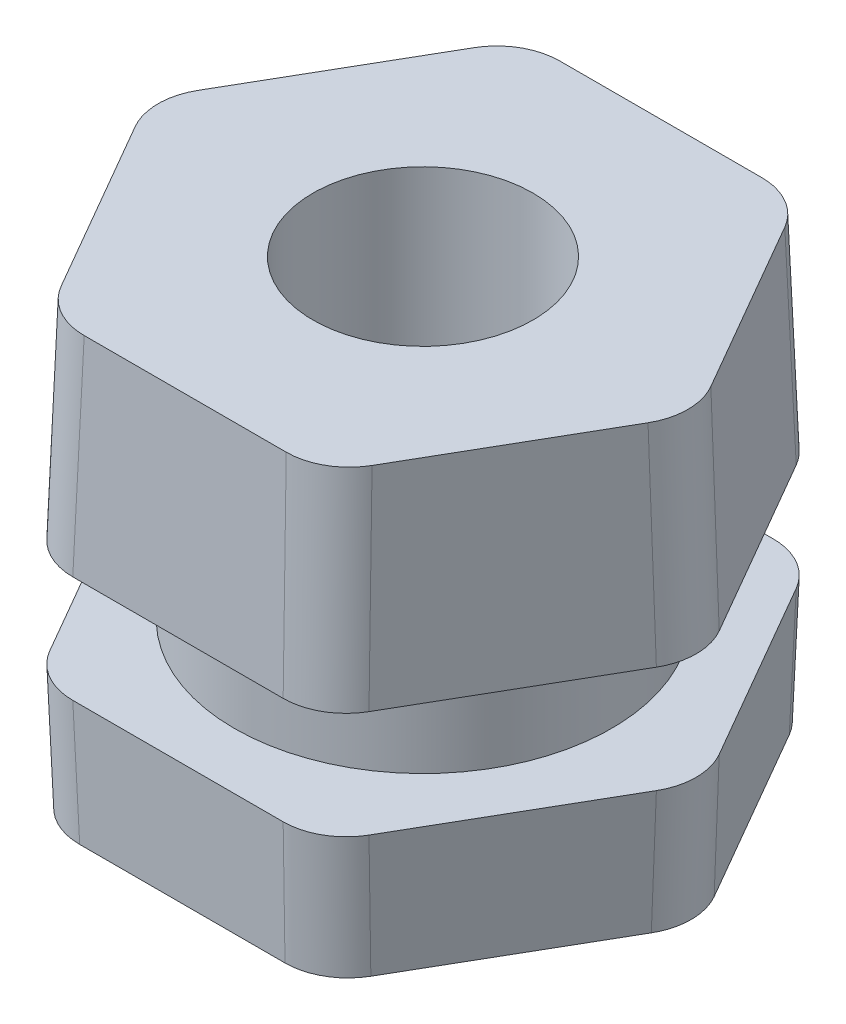
ISO-10303-21;
HEADER;
FILE_DESCRIPTION(('STEP AP214'),'2;1');
FILE_NAME('part.step','',(''),(''),'','','');
FILE_SCHEMA(('AUTOMOTIVE_DESIGN { 1 0 10303 214 1 1 1 1 }'));
ENDSEC;
DATA;
#1=APPLICATION_CONTEXT('core data for automotive mechanical design processes');
#2=APPLICATION_PROTOCOL_DEFINITION('international standard','automotive_design',2000,#1);
#3=PRODUCT_CONTEXT('',#1,'mechanical');
#4=PRODUCT('Part','Part','',(#3));
#5=PRODUCT_RELATED_PRODUCT_CATEGORY('part','',(#4));
#6=PRODUCT_DEFINITION_FORMATION('','',#4);
#7=PRODUCT_DEFINITION_CONTEXT('part definition',#1,'design');
#8=PRODUCT_DEFINITION('design','',#6,#7);
#9=PRODUCT_DEFINITION_SHAPE('','',#8);
#10=(LENGTH_UNIT() NAMED_UNIT(*) SI_UNIT(.MILLI.,.METRE.));
#11=(NAMED_UNIT(*) PLANE_ANGLE_UNIT() SI_UNIT($,.RADIAN.));
#12=(NAMED_UNIT(*) SI_UNIT($,.STERADIAN.) SOLID_ANGLE_UNIT());
#13=UNCERTAINTY_MEASURE_WITH_UNIT(LENGTH_MEASURE(1.E-05),#10,'distance_accuracy_value','');
#14=(GEOMETRIC_REPRESENTATION_CONTEXT(3) GLOBAL_UNCERTAINTY_ASSIGNED_CONTEXT((#13)) GLOBAL_UNIT_ASSIGNED_CONTEXT((#10,
#11,#12)) REPRESENTATION_CONTEXT('',''));
#15=CARTESIAN_POINT('',(0.,0.,0.));
#16=DIRECTION('',(0.,0.,1.));
#17=DIRECTION('',(1.,0.,0.));
#18=AXIS2_PLACEMENT_3D('',#15,#16,#17);
#19=CARTESIAN_POINT('',(3.2,1.28820864064763,0.));
#20=DIRECTION('',(0.,-1.,0.));
#21=DIRECTION('',(0.,0.,-1.));
#22=AXIS2_PLACEMENT_3D('',#19,#20,#21);
#23=PLANE('',#22);
#24=CARTESIAN_POINT('',(0.,1.28820864064763,0.));
#25=DIRECTION('',(0.,-1.,0.));
#26=DIRECTION('',(0.,0.,-1.));
#27=AXIS2_PLACEMENT_3D('',#24,#25,#26);
#28=CIRCLE('',#27,1.12);
#29=CARTESIAN_POINT('',(0.,1.28820864064763,-1.12));
#30=VERTEX_POINT('',#29);
#31=EDGE_CURVE('E431',#30,#30,#28,.T.);
#32=ORIENTED_EDGE('',*,*,#31,.F.);
#33=EDGE_LOOP('',(#32));
#34=FACE_BOUND('',#33,.T.);
#35=DIRECTION('',(0.5,0.,0.866025403784439));
#36=VECTOR('',#35,1.);
#37=CARTESIAN_POINT('',(-1.32128988992057,1.28820864064763,2.61036793502997));
#38=LINE('',#37,#36);
#39=CARTESIAN_POINT('',(-2.64374697973245,1.28820864064763,0.319805064646111));
#40=VERTEX_POINT('',#39);
#41=CARTESIAN_POINT('',(-1.59883280010868,1.28820864064763,2.12964951330364));
#42=VERTEX_POINT('',#41);
#43=EDGE_CURVE('E354',#40,#42,#38,.T.);
#44=ORIENTED_EDGE('',*,*,#43,.F.);
#45=CARTESIAN_POINT('',(-2.08892771700816,1.28820864064763,0.));
#46=DIRECTION('',(0.,-1.,0.));
#47=DIRECTION('',(-1.,0.,0.));
#48=AXIS2_PLACEMENT_3D('',#45,#46,#47);
#49=ELLIPSE('',#48,0.640520091669388,0.64);
#50=CARTESIAN_POINT('',(-2.64374697973245,1.28820864064763,-0.319805064646111));
#51=VERTEX_POINT('',#50);
#52=EDGE_CURVE('E287',#40,#51,#49,.T.);
#53=ORIENTED_EDGE('',*,*,#52,.T.);
#54=DIRECTION('',(-0.5,0.,0.866025403784439));
#55=VECTOR('',#54,1.);
#56=CARTESIAN_POINT('',(-1.32128988992057,1.28820864064763,-2.61036793502997));
#57=LINE('',#56,#55);
#58=CARTESIAN_POINT('',(-1.59883280010868,1.28820864064763,-2.12964951330364));
#59=VERTEX_POINT('',#58);
#60=EDGE_CURVE('E348',#59,#51,#57,.T.);
#61=ORIENTED_EDGE('',*,*,#60,.F.);
#62=CARTESIAN_POINT('',(-1.04446385850408,1.28820864064763,-1.8090644695985));
#63=DIRECTION('',(0.,-1.,0.));
#64=DIRECTION('',(-0.5,0.,-0.866025403784439));
#65=AXIS2_PLACEMENT_3D('',#62,#63,#64);
#66=ELLIPSE('',#65,0.640520091669388,0.64);
#67=CARTESIAN_POINT('',(-1.04491417962377,1.28820864064763,-2.44945457794974));
#68=VERTEX_POINT('',#67);
#69=EDGE_CURVE('E278',#59,#68,#66,.T.);
#70=ORIENTED_EDGE('',*,*,#69,.T.);
#71=DIRECTION('',(-1.,0.,0.));
#72=VECTOR('',#71,1.);
#73=CARTESIAN_POINT('',(3.2,1.28820864064763,-2.44945457794975));
#74=LINE('',#73,#72);
#75=CARTESIAN_POINT('',(1.04491417962377,1.28820864064763,-2.44945457794975));
#76=VERTEX_POINT('',#75);
#77=EDGE_CURVE('E359',#76,#68,#74,.T.);
#78=ORIENTED_EDGE('',*,*,#77,.F.);
#79=CARTESIAN_POINT('',(1.04446385850408,1.28820864064763,-1.8090644695985));
#80=DIRECTION('',(0.,-1.,0.));
#81=DIRECTION('',(0.5,0.,-0.866025403784439));
#82=AXIS2_PLACEMENT_3D('',#79,#80,#81);
#83=ELLIPSE('',#82,0.640520091669388,0.64);
#84=CARTESIAN_POINT('',(1.59883280010868,1.28820864064763,-2.12964951330364));
#85=VERTEX_POINT('',#84);
#86=EDGE_CURVE('E280',#76,#85,#83,.T.);
#87=ORIENTED_EDGE('',*,*,#86,.T.);
#88=DIRECTION('',(-0.5,0.,-0.866025403784438));
#89=VECTOR('',#88,1.);
#90=CARTESIAN_POINT('',(2.92128988992057,1.28820864064763,0.160913357080229));
#91=LINE('',#90,#89);
#92=CARTESIAN_POINT('',(2.64374697973246,1.28820864064763,-0.319805064646111));
#93=VERTEX_POINT('',#92);
#94=EDGE_CURVE('E363',#93,#85,#91,.T.);
#95=ORIENTED_EDGE('',*,*,#94,.F.);
#96=CARTESIAN_POINT('',(2.08892771700816,1.28820864064763,0.));
#97=DIRECTION('',(0.,-1.,0.));
#98=DIRECTION('',(1.,0.,0.));
#99=AXIS2_PLACEMENT_3D('',#96,#97,#98);
#100=ELLIPSE('',#99,0.640520091669388,0.64);
#101=CARTESIAN_POINT('',(2.64374697973246,1.28820864064763,0.319805064646111));
#102=VERTEX_POINT('',#101);
#103=EDGE_CURVE('E282',#93,#102,#100,.T.);
#104=ORIENTED_EDGE('',*,*,#103,.T.);
#105=DIRECTION('',(0.5,0.,-0.866025403784439));
#106=VECTOR('',#105,1.);
#107=CARTESIAN_POINT('',(2.92128988992057,1.28820864064763,-0.160913357080229));
#108=LINE('',#107,#106);
#109=CARTESIAN_POINT('',(1.59883280010869,1.28820864064763,2.12964951330364));
#110=VERTEX_POINT('',#109);
#111=EDGE_CURVE('E365',#110,#102,#108,.T.);
#112=ORIENTED_EDGE('',*,*,#111,.F.);
#113=CARTESIAN_POINT('',(1.04446385850408,1.28820864064763,1.8090644695985));
#114=DIRECTION('',(0.,-1.,0.));
#115=DIRECTION('',(0.5,0.,0.866025403784439));
#116=AXIS2_PLACEMENT_3D('',#113,#114,#115);
#117=ELLIPSE('',#116,0.640520091669388,0.64);
#118=CARTESIAN_POINT('',(1.04491417962377,1.28820864064763,2.44945457794974));
#119=VERTEX_POINT('',#118);
#120=EDGE_CURVE('E49',#110,#119,#117,.T.);
#121=ORIENTED_EDGE('',*,*,#120,.T.);
#122=DIRECTION('',(1.,0.,0.));
#123=VECTOR('',#122,1.);
#124=CARTESIAN_POINT('',(3.2,1.28820864064763,2.44945457794974));
#125=LINE('',#124,#123);
#126=CARTESIAN_POINT('',(-1.04491417962377,1.28820864064763,2.44945457794975));
#127=VERTEX_POINT('',#126);
#128=EDGE_CURVE('E229',#127,#119,#125,.T.);
#129=ORIENTED_EDGE('',*,*,#128,.F.);
#130=CARTESIAN_POINT('',(-1.04446385850408,1.28820864064763,1.8090644695985));
#131=DIRECTION('',(0.,-1.,0.));
#132=DIRECTION('',(-0.5,0.,0.866025403784439));
#133=AXIS2_PLACEMENT_3D('',#130,#131,#132);
#134=ELLIPSE('',#133,0.640520091669388,0.64);
#135=EDGE_CURVE('E285',#127,#42,#134,.T.);
#136=ORIENTED_EDGE('',*,*,#135,.T.);
#137=EDGE_LOOP('',(#44,#53,#61,#70,#78,#87,#95,#104,#112,#121,#129,#136));
#138=FACE_BOUND('',#137,.T.);
#139=ADVANCED_FACE('F34',(#34,#138),#23,.T.);
#140=CARTESIAN_POINT('',(1.12,5.76820864064763,0.));
#141=DIRECTION('',(0.,1.,0.));
#142=DIRECTION('',(0.,0.,1.));
#143=AXIS2_PLACEMENT_3D('',#140,#141,#142);
#144=PLANE('',#143);
#145=CARTESIAN_POINT('',(0.,5.76820864064763,0.));
#146=DIRECTION('',(0.,-1.,0.));
#147=DIRECTION('',(0.,0.,-1.));
#148=AXIS2_PLACEMENT_3D('',#145,#146,#147);
#149=CIRCLE('',#148,1.12);
#150=CARTESIAN_POINT('',(0.,5.76820864064763,-1.12));
#151=VERTEX_POINT('',#150);
#152=EDGE_CURVE('E428',#151,#151,#149,.T.);
#153=ORIENTED_EDGE('',*,*,#152,.T.);
#154=EDGE_LOOP('',(#153));
#155=FACE_BOUND('',#154,.T.);
#156=DIRECTION('',(-0.5,0.,0.866025403784439));
#157=VECTOR('',#156,1.);
#158=CARTESIAN_POINT('',(-1.81612831836894,5.76820864064763,-1.69517447498559));
#159=LINE('',#158,#157);
#160=CARTESIAN_POINT('',(-1.58205841907427,5.76820864064763,-2.1005954330865));
#161=VERTEX_POINT('',#160);
#162=CARTESIAN_POINT('',(-2.61019821766362,5.76820864064763,-0.31980506464611));
#163=VERTEX_POINT('',#162);
#164=EDGE_CURVE('E200',#161,#163,#159,.T.);
#165=ORIENTED_EDGE('',*,*,#164,.T.);
#166=CARTESIAN_POINT('',(-2.05537895493932,5.76820864064763,0.));
#167=DIRECTION('',(0.,1.,0.));
#168=DIRECTION('',(1.,0.,0.));
#169=AXIS2_PLACEMENT_3D('',#166,#167,#168);
#170=ELLIPSE('',#169,0.640520091669388,0.64);
#171=CARTESIAN_POINT('',(-2.61019821766362,5.76820864064763,0.319805064646113));
#172=VERTEX_POINT('',#171);
#173=EDGE_CURVE('E238',#163,#172,#170,.T.);
#174=ORIENTED_EDGE('',*,*,#173,.T.);
#175=DIRECTION('',(0.5,0.,0.866025403784439));
#176=VECTOR('',#175,1.);
#177=CARTESIAN_POINT('',(-1.81612831836894,5.76820864064763,1.69517447498559));
#178=LINE('',#177,#176);
#179=CARTESIAN_POINT('',(-1.58205841907427,5.76820864064763,2.1005954330865));
#180=VERTEX_POINT('',#179);
#181=EDGE_CURVE('E217',#172,#180,#178,.T.);
#182=ORIENTED_EDGE('',*,*,#181,.T.);
#183=CARTESIAN_POINT('',(-1.02768947746966,5.76820864064763,1.78001038938137));
#184=DIRECTION('',(0.,1.,0.));
#185=DIRECTION('',(0.5,0.,-0.866025403784439));
#186=AXIS2_PLACEMENT_3D('',#183,#184,#185);
#187=ELLIPSE('',#186,0.640520091669388,0.64);
#188=CARTESIAN_POINT('',(-1.02813979858935,5.76820864064763,2.42040049773261));
#189=VERTEX_POINT('',#188);
#190=EDGE_CURVE('E236',#180,#189,#187,.T.);
#191=ORIENTED_EDGE('',*,*,#190,.T.);
#192=DIRECTION('',(1.,0.,0.));
#193=VECTOR('',#192,1.);
#194=CARTESIAN_POINT('',(1.12,5.76820864064763,2.42040049773261));
#195=LINE('',#194,#193);
#196=CARTESIAN_POINT('',(1.02813979858935,5.76820864064763,2.42040049773261));
#197=VERTEX_POINT('',#196);
#198=EDGE_CURVE('E350',#189,#197,#195,.T.);
#199=ORIENTED_EDGE('',*,*,#198,.T.);
#200=CARTESIAN_POINT('',(1.02768947746966,5.76820864064763,1.78001038938136));
#201=DIRECTION('',(0.,1.,0.));
#202=DIRECTION('',(-0.5,0.,-0.866025403784439));
#203=AXIS2_PLACEMENT_3D('',#200,#201,#202);
#204=ELLIPSE('',#203,0.640520091669388,0.64);
#205=CARTESIAN_POINT('',(1.58205841907427,5.76820864064763,2.1005954330865));
#206=VERTEX_POINT('',#205);
#207=EDGE_CURVE('E234',#197,#206,#204,.T.);
#208=ORIENTED_EDGE('',*,*,#207,.T.);
#209=DIRECTION('',(0.5,0.,-0.866025403784439));
#210=VECTOR('',#209,1.);
#211=CARTESIAN_POINT('',(2.37612831836894,5.76820864064763,0.725226022747021));
#212=LINE('',#211,#210);
#213=CARTESIAN_POINT('',(2.61019821766362,5.76820864064763,0.319805064646111));
#214=VERTEX_POINT('',#213);
#215=EDGE_CURVE('E346',#206,#214,#212,.T.);
#216=ORIENTED_EDGE('',*,*,#215,.T.);
#217=CARTESIAN_POINT('',(2.05537895493933,5.76820864064763,0.));
#218=DIRECTION('',(0.,1.,0.));
#219=DIRECTION('',(-1.,0.,0.));
#220=AXIS2_PLACEMENT_3D('',#217,#218,#219);
#221=ELLIPSE('',#220,0.640520091669388,0.64);
#222=CARTESIAN_POINT('',(2.61019821766362,5.76820864064763,-0.319805064646111));
#223=VERTEX_POINT('',#222);
#224=EDGE_CURVE('E206',#214,#223,#221,.T.);
#225=ORIENTED_EDGE('',*,*,#224,.T.);
#226=DIRECTION('',(-0.5,0.,-0.866025403784438));
#227=VECTOR('',#226,1.);
#228=CARTESIAN_POINT('',(2.37612831836894,5.76820864064763,-0.725226022747021));
#229=LINE('',#228,#227);
#230=CARTESIAN_POINT('',(1.58205841907427,5.76820864064763,-2.1005954330865));
#231=VERTEX_POINT('',#230);
#232=EDGE_CURVE('E343',#223,#231,#229,.T.);
#233=ORIENTED_EDGE('',*,*,#232,.T.);
#234=CARTESIAN_POINT('',(1.02768947746966,5.76820864064763,-1.78001038938137));
#235=DIRECTION('',(0.,1.,0.));
#236=DIRECTION('',(-0.5,0.,0.866025403784439));
#237=AXIS2_PLACEMENT_3D('',#234,#235,#236);
#238=ELLIPSE('',#237,0.640520091669388,0.64);
#239=CARTESIAN_POINT('',(1.02813979858935,5.76820864064763,-2.42040049773261));
#240=VERTEX_POINT('',#239);
#241=EDGE_CURVE('E207',#231,#240,#238,.T.);
#242=ORIENTED_EDGE('',*,*,#241,.T.);
#243=DIRECTION('',(-1.,0.,0.));
#244=VECTOR('',#243,1.);
#245=CARTESIAN_POINT('',(1.12,5.76820864064763,-2.42040049773261));
#246=LINE('',#245,#244);
#247=CARTESIAN_POINT('',(-1.02813979858935,5.76820864064763,-2.42040049773261));
#248=VERTEX_POINT('',#247);
#249=EDGE_CURVE('E202',#240,#248,#246,.T.);
#250=ORIENTED_EDGE('',*,*,#249,.T.);
#251=CARTESIAN_POINT('',(-1.02768947746966,5.76820864064763,-1.78001038938137));
#252=DIRECTION('',(0.,1.,0.));
#253=DIRECTION('',(0.5,0.,0.866025403784439));
#254=AXIS2_PLACEMENT_3D('',#251,#252,#253);
#255=ELLIPSE('',#254,0.640520091669388,0.64);
#256=EDGE_CURVE('E197',#248,#161,#255,.T.);
#257=ORIENTED_EDGE('',*,*,#256,.T.);
#258=EDGE_LOOP('',(#165,#174,#182,#191,#199,#208,#216,#225,#233,#242,#250,#257));
#259=FACE_BOUND('',#258,.T.);
#260=ADVANCED_FACE('F199',(#155,#259),#144,.T.);
#261=CARTESIAN_POINT('',(0.,1.28820864064763,0.));
#262=DIRECTION('',(0.,-1.,0.));
#263=DIRECTION('',(0.,0.,-1.));
#264=AXIS2_PLACEMENT_3D('',#261,#262,#263);
#265=CYLINDRICAL_SURFACE('',#264,1.12);
#266=ORIENTED_EDGE('',*,*,#31,.T.);
#267=EDGE_LOOP('',(#266));
#268=FACE_BOUND('',#267,.T.);
#269=ORIENTED_EDGE('',*,*,#152,.F.);
#270=EDGE_LOOP('',(#269));
#271=FACE_BOUND('',#270,.T.);
#272=ADVANCED_FACE('F486',(#268,#271),#265,.F.);
#273=CARTESIAN_POINT('',(-1.36,2.56820864064763,2.63271722750469));
#274=DIRECTION('',(-0.865497844507676,-0.034899496702501,0.499695413509548));
#275=DIRECTION('',(0.5,0.,0.866025403784439));
#276=AXIS2_PLACEMENT_3D('',#273,#274,#275);
#277=PLANE('',#276);
#278=DIRECTION('',(0.5,0.,0.866025403784439));
#279=VECTOR('',#278,1.);
#280=CARTESIAN_POINT('',(-1.36,2.56820864064763,2.63271722750469));
#281=LINE('',#280,#279);
#282=CARTESIAN_POINT('',(-2.69536045983836,2.56820864064763,0.31980506464611));
#283=VERTEX_POINT('',#282);
#284=CARTESIAN_POINT('',(-1.62463954016163,2.56820864064763,2.17434809825307));
#285=VERTEX_POINT('',#284);
#286=EDGE_CURVE('E387',#283,#285,#281,.T.);
#287=ORIENTED_EDGE('',*,*,#286,.F.);
#288=DIRECTION('',(-0.0402902897014406,0.999188016619382,0.));
#289=VECTOR('',#288,1.);
#290=CARTESIAN_POINT('',(-2.69319275926318,2.51445026724328,0.319805064646111));
#291=LINE('',#290,#289);
#292=EDGE_CURVE('E276',#283,#40,#291,.F.);
#293=ORIENTED_EDGE('',*,*,#292,.T.);
#294=ORIENTED_EDGE('',*,*,#43,.T.);
#295=DIRECTION('',(-0.0201451448507203,0.999188016619382,0.0348924144072821));
#296=VECTOR('',#295,1.);
#297=CARTESIAN_POINT('',(-1.62485433582943,2.57886238669257,2.17472013526293));
#298=LINE('',#297,#296);
#299=EDGE_CURVE('E273',#42,#285,#298,.T.);
#300=ORIENTED_EDGE('',*,*,#299,.T.);
#301=EDGE_LOOP('',(#287,#293,#294,#300));
#302=FACE_BOUND('',#301,.T.);
#303=ADVANCED_FACE('F437',(#302),#277,.T.);
#304=CARTESIAN_POINT('',(3.2,2.56820864064763,2.49415316289918));
#305=DIRECTION('',(0.,-0.034899496702501,0.999390827019096));
#306=DIRECTION('',(0.,-0.999390827019096,-0.034899496702501));
#307=AXIS2_PLACEMENT_3D('',#304,#305,#306);
#308=PLANE('',#307);
#309=DIRECTION('',(1.,0.,0.));
#310=VECTOR('',#309,1.);
#311=CARTESIAN_POINT('',(3.2,2.56820864064763,2.49415316289918));
#312=LINE('',#311,#310);
#313=CARTESIAN_POINT('',(-1.07072091967672,2.56820864064763,2.49415316289918));
#314=VERTEX_POINT('',#313);
#315=CARTESIAN_POINT('',(1.07072091967673,2.56820864064763,2.49415316289918));
#316=VERTEX_POINT('',#315);
#317=EDGE_CURVE('E381',#314,#316,#312,.T.);
#318=ORIENTED_EDGE('',*,*,#317,.F.);
#319=DIRECTION('',(-0.0201451448507203,0.999188016619382,0.0348924144072821));
#320=VECTOR('',#319,1.);
#321=CARTESIAN_POINT('',(-1.06898774641144,2.48224420751864,2.4911512187454));
#322=LINE('',#321,#320);
#323=EDGE_CURVE('E56',#314,#127,#322,.F.);
#324=ORIENTED_EDGE('',*,*,#323,.T.);
#325=ORIENTED_EDGE('',*,*,#128,.T.);
#326=DIRECTION('',(0.0201451448507203,0.999188016619382,0.0348924144072821));
#327=VECTOR('',#326,1.);
#328=CARTESIAN_POINT('',(1.07158503832221,2.61106844641721,2.49564986029692));
#329=LINE('',#328,#327);
#330=EDGE_CURVE('E294',#119,#316,#329,.T.);
#331=ORIENTED_EDGE('',*,*,#330,.T.);
#332=EDGE_LOOP('',(#318,#324,#325,#331));
#333=FACE_BOUND('',#332,.T.);
#334=ADVANCED_FACE('F370',(#333),#308,.T.);
#335=CARTESIAN_POINT('',(2.96,2.56820864064763,-0.13856406460551));
#336=DIRECTION('',(0.865497844507677,-0.034899496702501,0.499695413509548));
#337=DIRECTION('',(0.5,0.,-0.866025403784439));
#338=AXIS2_PLACEMENT_3D('',#335,#336,#337);
#339=PLANE('',#338);
#340=DIRECTION('',(0.5,0.,-0.866025403784439));
#341=VECTOR('',#340,1.);
#342=CARTESIAN_POINT('',(2.96,2.56820864064763,-0.13856406460551));
#343=LINE('',#342,#341);
#344=CARTESIAN_POINT('',(1.62463954016164,2.56820864064763,2.17434809825307));
#345=VERTEX_POINT('',#344);
#346=CARTESIAN_POINT('',(2.69536045983836,2.56820864064763,0.319805064646111));
#347=VERTEX_POINT('',#346);
#348=EDGE_CURVE('E380',#345,#347,#343,.T.);
#349=ORIENTED_EDGE('',*,*,#348,.F.);
#350=DIRECTION('',(0.0201451448507203,0.999188016619382,0.0348924144072821));
#351=VECTOR('',#350,1.);
#352=CARTESIAN_POINT('',(1.62355568987405,2.51445026724328,2.17247081448717));
#353=LINE('',#352,#351);
#354=EDGE_CURVE('E306',#345,#110,#353,.F.);
#355=ORIENTED_EDGE('',*,*,#354,.T.);
#356=ORIENTED_EDGE('',*,*,#111,.T.);
#357=DIRECTION('',(0.0402902897014406,0.999188016619382,0.));
#358=VECTOR('',#357,1.);
#359=CARTESIAN_POINT('',(2.69579005117394,2.57886238669257,0.319805064646111));
#360=LINE('',#359,#358);
#361=EDGE_CURVE('E303',#102,#347,#360,.T.);
#362=ORIENTED_EDGE('',*,*,#361,.T.);
#363=EDGE_LOOP('',(#349,#355,#356,#362));
#364=FACE_BOUND('',#363,.T.);
#365=ADVANCED_FACE('F382',(#364),#339,.T.);
#366=CARTESIAN_POINT('',(2.96,2.56820864064763,0.13856406460551));
#367=DIRECTION('',(0.865497844507677,-0.034899496702501,-0.499695413509548));
#368=DIRECTION('',(-0.5,0.,-0.866025403784438));
#369=AXIS2_PLACEMENT_3D('',#366,#367,#368);
#370=PLANE('',#369);
#371=DIRECTION('',(-0.5,0.,-0.866025403784439));
#372=VECTOR('',#371,1.);
#373=CARTESIAN_POINT('',(2.96,2.56820864064763,0.13856406460551));
#374=LINE('',#373,#372);
#375=CARTESIAN_POINT('',(2.69536045983836,2.56820864064763,-0.319805064646111));
#376=VERTEX_POINT('',#375);
#377=CARTESIAN_POINT('',(1.62463954016164,2.56820864064763,-2.17434809825308));
#378=VERTEX_POINT('',#377);
#379=EDGE_CURVE('E383',#376,#378,#374,.T.);
#380=ORIENTED_EDGE('',*,*,#379,.F.);
#381=DIRECTION('',(0.0402902897014406,0.999188016619382,0.));
#382=VECTOR('',#381,1.);
#383=CARTESIAN_POINT('',(2.69579005117394,2.57886238669257,-0.319805064646111));
#384=LINE('',#383,#382);
#385=EDGE_CURVE('E316',#376,#93,#384,.F.);
#386=ORIENTED_EDGE('',*,*,#385,.T.);
#387=ORIENTED_EDGE('',*,*,#94,.T.);
#388=DIRECTION('',(0.0201451448507203,0.999188016619382,-0.0348924144072821));
#389=VECTOR('',#388,1.);
#390=CARTESIAN_POINT('',(1.62355568987405,2.51445026724328,-2.17247081448717));
#391=LINE('',#390,#389);
#392=EDGE_CURVE('E313',#85,#378,#391,.T.);
#393=ORIENTED_EDGE('',*,*,#392,.T.);
#394=EDGE_LOOP('',(#380,#386,#387,#393));
#395=FACE_BOUND('',#394,.T.);
#396=ADVANCED_FACE('F466',(#395),#370,.T.);
#397=CARTESIAN_POINT('',(3.2,2.56820864064763,-2.49415316289918));
#398=DIRECTION('',(0.,-0.034899496702501,-0.999390827019096));
#399=DIRECTION('',(0.,0.999390827019096,-0.034899496702501));
#400=AXIS2_PLACEMENT_3D('',#397,#398,#399);
#401=PLANE('',#400);
#402=DIRECTION('',(-1.,0.,0.));
#403=VECTOR('',#402,1.);
#404=CARTESIAN_POINT('',(3.2,2.56820864064763,-2.49415316289918));
#405=LINE('',#404,#403);
#406=CARTESIAN_POINT('',(1.07072091967672,2.56820864064763,-2.49415316289918));
#407=VERTEX_POINT('',#406);
#408=CARTESIAN_POINT('',(-1.07072091967673,2.56820864064763,-2.49415316289918));
#409=VERTEX_POINT('',#408);
#410=EDGE_CURVE('E226',#407,#409,#405,.T.);
#411=ORIENTED_EDGE('',*,*,#410,.F.);
#412=DIRECTION('',(0.0201451448507203,0.999188016619382,-0.0348924144072821));
#413=VECTOR('',#412,1.);
#414=CARTESIAN_POINT('',(1.07158503832221,2.61106844641721,-2.49564986029692));
#415=LINE('',#414,#413);
#416=EDGE_CURVE('E321',#407,#76,#415,.F.);
#417=ORIENTED_EDGE('',*,*,#416,.T.);
#418=ORIENTED_EDGE('',*,*,#77,.T.);
#419=DIRECTION('',(-0.0201451448507203,0.999188016619382,-0.0348924144072821));
#420=VECTOR('',#419,1.);
#421=CARTESIAN_POINT('',(-1.06898774641144,2.48224420751864,-2.4911512187454));
#422=LINE('',#421,#420);
#423=EDGE_CURVE('E318',#68,#409,#422,.T.);
#424=ORIENTED_EDGE('',*,*,#423,.T.);
#425=EDGE_LOOP('',(#411,#417,#418,#424));
#426=FACE_BOUND('',#425,.T.);
#427=ADVANCED_FACE('F457',(#426),#401,.T.);
#428=CARTESIAN_POINT('',(-1.36,2.56820864064763,-2.63271722750469));
#429=DIRECTION('',(-0.865497844507677,-0.034899496702501,-0.499695413509548));
#430=DIRECTION('',(-0.5,0.,0.866025403784439));
#431=AXIS2_PLACEMENT_3D('',#428,#429,#430);
#432=PLANE('',#431);
#433=ORIENTED_EDGE('',*,*,#60,.T.);
#434=DIRECTION('',(-0.0402902897014406,0.999188016619382,0.));
#435=VECTOR('',#434,1.);
#436=CARTESIAN_POINT('',(-2.69319275926318,2.51445026724328,-0.319805064646111));
#437=LINE('',#436,#435);
#438=CARTESIAN_POINT('',(-2.69536045983836,2.56820864064763,-0.31980506464611));
#439=VERTEX_POINT('',#438);
#440=EDGE_CURVE('E258',#51,#439,#437,.T.);
#441=ORIENTED_EDGE('',*,*,#440,.T.);
#442=DIRECTION('',(-0.5,0.,0.866025403784439));
#443=VECTOR('',#442,1.);
#444=CARTESIAN_POINT('',(-1.36,2.56820864064763,-2.63271722750469));
#445=LINE('',#444,#443);
#446=CARTESIAN_POINT('',(-1.62463954016164,2.56820864064763,-2.17434809825307));
#447=VERTEX_POINT('',#446);
#448=EDGE_CURVE('E222',#447,#439,#445,.T.);
#449=ORIENTED_EDGE('',*,*,#448,.F.);
#450=DIRECTION('',(-0.0201451448507203,0.999188016619382,-0.0348924144072821));
#451=VECTOR('',#450,1.);
#452=CARTESIAN_POINT('',(-1.62485433582943,2.57886238669257,-2.17472013526293));
#453=LINE('',#452,#451);
#454=EDGE_CURVE('E256',#447,#59,#453,.F.);
#455=ORIENTED_EDGE('',*,*,#454,.T.);
#456=EDGE_LOOP('',(#433,#441,#449,#455));
#457=FACE_BOUND('',#456,.T.);
#458=ADVANCED_FACE('F447',(#457),#432,.T.);
#459=CARTESIAN_POINT('',(-1.68,3.65620864064763,-2.07846096908265));
#460=DIRECTION('',(-0.865497844507677,0.034899496702501,-0.499695413509548));
#461=DIRECTION('',(-0.5,0.,0.866025403784439));
#462=AXIS2_PLACEMENT_3D('',#459,#460,#461);
#463=PLANE('',#462);
#464=DIRECTION('',(0.5,0.,-0.866025403784439));
#465=VECTOR('',#464,1.);
#466=CARTESIAN_POINT('',(-1.68,3.65620864064763,-2.07846096908265));
#467=LINE('',#466,#465);
#468=CARTESIAN_POINT('',(-2.69536045983836,3.65620864064763,-0.319805064646108));
#469=VERTEX_POINT('',#468);
#470=CARTESIAN_POINT('',(-1.62463954016164,3.65620864064763,-2.17434809825307));
#471=VERTEX_POINT('',#470);
#472=EDGE_CURVE('E335',#469,#471,#467,.T.);
#473=ORIENTED_EDGE('',*,*,#472,.F.);
#474=DIRECTION('',(0.0402902897014406,0.999188016619382,0.));
#475=VECTOR('',#474,1.);
#476=CARTESIAN_POINT('',(-2.69371221764533,3.69708459016212,-0.319805064646109));
#477=LINE('',#476,#475);
#478=EDGE_CURVE('E216',#469,#163,#477,.T.);
#479=ORIENTED_EDGE('',*,*,#478,.T.);
#480=ORIENTED_EDGE('',*,*,#164,.F.);
#481=DIRECTION('',(0.0201451448507203,0.999188016619382,0.0348924144072821));
#482=VECTOR('',#481,1.);
#483=CARTESIAN_POINT('',(-1.62459460663835,3.65843731849255,-2.17427027110778));
#484=LINE('',#483,#482);
#485=EDGE_CURVE('E213',#161,#471,#484,.F.);
#486=ORIENTED_EDGE('',*,*,#485,.T.);
#487=EDGE_LOOP('',(#473,#479,#480,#486));
#488=FACE_BOUND('',#487,.T.);
#489=ADVANCED_FACE('F212',(#488),#463,.T.);
#490=CARTESIAN_POINT('',(1.92,3.65620864064763,-2.49415316289918));
#491=DIRECTION('',(0.,0.034899496702501,-0.999390827019096));
#492=DIRECTION('',(0.,0.999390827019096,0.034899496702501));
#493=AXIS2_PLACEMENT_3D('',#490,#491,#492);
#494=PLANE('',#493);
#495=DIRECTION('',(1.,0.,0.));
#496=VECTOR('',#495,1.);
#497=CARTESIAN_POINT('',(1.92,3.65620864064763,-2.49415316289918));
#498=LINE('',#497,#496);
#499=CARTESIAN_POINT('',(-1.07072091967672,3.65620864064763,-2.49415316289918));
#500=VERTEX_POINT('',#499);
#501=CARTESIAN_POINT('',(1.07072091967672,3.65620864064763,-2.49415316289918));
#502=VERTEX_POINT('',#501);
#503=EDGE_CURVE('E327',#500,#502,#498,.T.);
#504=ORIENTED_EDGE('',*,*,#503,.F.);
#505=DIRECTION('',(0.0201451448507203,0.999188016619382,0.0348924144072821));
#506=VECTOR('',#505,1.);
#507=CARTESIAN_POINT('',(-1.0695072047936,3.71640822599691,-2.4920509470557));
#508=LINE('',#507,#506);
#509=EDGE_CURVE('E11',#500,#248,#508,.T.);
#510=ORIENTED_EDGE('',*,*,#509,.T.);
#511=ORIENTED_EDGE('',*,*,#249,.F.);
#512=DIRECTION('',(-0.0201451448507203,0.999188016619382,0.0348924144072821));
#513=VECTOR('',#512,1.);
#514=CARTESIAN_POINT('',(1.07106557994005,3.63911368265777,-2.49475013198662));
#515=LINE('',#514,#513);
#516=EDGE_CURVE('E42',#240,#502,#515,.F.);
#517=ORIENTED_EDGE('',*,*,#516,.T.);
#518=EDGE_LOOP('',(#504,#510,#511,#517));
#519=FACE_BOUND('',#518,.T.);
#520=ADVANCED_FACE('F326',(#519),#494,.T.);
#521=CARTESIAN_POINT('',(2.64,3.65620864064763,-0.41569219381653));
#522=DIRECTION('',(0.865497844507677,0.034899496702501,-0.499695413509548));
#523=DIRECTION('',(-0.5,0.,-0.866025403784438));
#524=AXIS2_PLACEMENT_3D('',#521,#522,#523);
#525=PLANE('',#524);
#526=ORIENTED_EDGE('',*,*,#232,.F.);
#527=DIRECTION('',(-0.0402902897014406,0.999188016619382,0.));
#528=VECTOR('',#527,1.);
#529=CARTESIAN_POINT('',(2.69527059279179,3.65843731849255,-0.319805064646111));
#530=LINE('',#529,#528);
#531=CARTESIAN_POINT('',(2.69536045983836,3.65620864064763,-0.319805064646111));
#532=VERTEX_POINT('',#531);
#533=EDGE_CURVE('E311',#223,#532,#530,.F.);
#534=ORIENTED_EDGE('',*,*,#533,.T.);
#535=DIRECTION('',(0.5,0.,0.866025403784439));
#536=VECTOR('',#535,1.);
#537=CARTESIAN_POINT('',(2.64,3.65620864064763,-0.41569219381653));
#538=LINE('',#537,#536);
#539=CARTESIAN_POINT('',(1.62463954016164,3.65620864064763,-2.17434809825307));
#540=VERTEX_POINT('',#539);
#541=EDGE_CURVE('E336',#540,#532,#538,.T.);
#542=ORIENTED_EDGE('',*,*,#541,.F.);
#543=DIRECTION('',(-0.0201451448507203,0.999188016619382,0.0348924144072821));
#544=VECTOR('',#543,1.);
#545=CARTESIAN_POINT('',(1.62381541906512,3.69708459016212,-2.17292067864232));
#546=LINE('',#545,#544);
#547=EDGE_CURVE('E308',#540,#231,#546,.T.);
#548=ORIENTED_EDGE('',*,*,#547,.T.);
#549=EDGE_LOOP('',(#526,#534,#542,#548));
#550=FACE_BOUND('',#549,.T.);
#551=ADVANCED_FACE('F342',(#550),#525,.T.);
#552=CARTESIAN_POINT('',(2.64,3.65620864064763,0.415692193816531));
#553=DIRECTION('',(0.865497844507677,0.034899496702501,0.499695413509548));
#554=DIRECTION('',(0.5,0.,-0.866025403784439));
#555=AXIS2_PLACEMENT_3D('',#552,#553,#554);
#556=PLANE('',#555);
#557=ORIENTED_EDGE('',*,*,#215,.F.);
#558=DIRECTION('',(-0.0201451448507203,0.999188016619382,-0.0348924144072821));
#559=VECTOR('',#558,1.);
#560=CARTESIAN_POINT('',(1.62381541906512,3.69708459016212,2.17292067864232));
#561=LINE('',#560,#559);
#562=CARTESIAN_POINT('',(1.62463954016164,3.65620864064763,2.17434809825307));
#563=VERTEX_POINT('',#562);
#564=EDGE_CURVE('E301',#206,#563,#561,.F.);
#565=ORIENTED_EDGE('',*,*,#564,.T.);
#566=DIRECTION('',(-0.5,0.,0.866025403784439));
#567=VECTOR('',#566,1.);
#568=CARTESIAN_POINT('',(2.64,3.65620864064763,0.415692193816531));
#569=LINE('',#568,#567);
#570=CARTESIAN_POINT('',(2.69536045983836,3.65620864064763,0.319805064646111));
#571=VERTEX_POINT('',#570);
#572=EDGE_CURVE('E415',#571,#563,#569,.T.);
#573=ORIENTED_EDGE('',*,*,#572,.F.);
#574=DIRECTION('',(-0.0402902897014406,0.999188016619382,0.));
#575=VECTOR('',#574,1.);
#576=CARTESIAN_POINT('',(2.69527059279179,3.65843731849255,0.319805064646111));
#577=LINE('',#576,#575);
#578=EDGE_CURVE('E298',#571,#214,#577,.T.);
#579=ORIENTED_EDGE('',*,*,#578,.T.);
#580=EDGE_LOOP('',(#557,#565,#573,#579));
#581=FACE_BOUND('',#580,.T.);
#582=ADVANCED_FACE('F498',(#581),#556,.T.);
#583=CARTESIAN_POINT('',(1.92,3.65620864064763,2.49415316289918));
#584=DIRECTION('',(0.,0.034899496702501,0.999390827019096));
#585=DIRECTION('',(0.,-0.999390827019096,0.034899496702501));
#586=AXIS2_PLACEMENT_3D('',#583,#584,#585);
#587=PLANE('',#586);
#588=ORIENTED_EDGE('',*,*,#198,.F.);
#589=DIRECTION('',(0.0201451448507203,0.999188016619382,-0.0348924144072821));
#590=VECTOR('',#589,1.);
#591=CARTESIAN_POINT('',(-1.06950720479359,3.71640822599691,2.4920509470557));
#592=LINE('',#591,#590);
#593=CARTESIAN_POINT('',(-1.07072091967672,3.65620864064763,2.49415316289918));
#594=VERTEX_POINT('',#593);
#595=EDGE_CURVE('E292',#189,#594,#592,.F.);
#596=ORIENTED_EDGE('',*,*,#595,.T.);
#597=DIRECTION('',(-1.,0.,0.));
#598=VECTOR('',#597,1.);
#599=CARTESIAN_POINT('',(1.92,3.65620864064763,2.49415316289918));
#600=LINE('',#599,#598);
#601=CARTESIAN_POINT('',(1.07072091967673,3.65620864064763,2.49415316289918));
#602=VERTEX_POINT('',#601);
#603=EDGE_CURVE('E409',#602,#594,#600,.T.);
#604=ORIENTED_EDGE('',*,*,#603,.F.);
#605=DIRECTION('',(-0.0201451448507203,0.999188016619382,-0.0348924144072821));
#606=VECTOR('',#605,1.);
#607=CARTESIAN_POINT('',(1.07106557994005,3.63911368265777,2.49475013198662));
#608=LINE('',#607,#606);
#609=EDGE_CURVE('E289',#602,#197,#608,.T.);
#610=ORIENTED_EDGE('',*,*,#609,.T.);
#611=EDGE_LOOP('',(#588,#596,#604,#610));
#612=FACE_BOUND('',#611,.T.);
#613=ADVANCED_FACE('F399',(#612),#587,.T.);
#614=CARTESIAN_POINT('',(-1.68,3.65620864064763,2.07846096908265));
#615=DIRECTION('',(-0.865497844507676,0.034899496702501,0.499695413509548));
#616=DIRECTION('',(0.5,0.,0.866025403784439));
#617=AXIS2_PLACEMENT_3D('',#614,#615,#616);
#618=PLANE('',#617);
#619=ORIENTED_EDGE('',*,*,#181,.F.);
#620=DIRECTION('',(0.0402902897014406,0.999188016619382,0.));
#621=VECTOR('',#620,1.);
#622=CARTESIAN_POINT('',(-2.69371221764533,3.69708459016212,0.319805064646112));
#623=LINE('',#622,#621);
#624=CARTESIAN_POINT('',(-2.69536045983836,3.65620864064763,0.319805064646112));
#625=VERTEX_POINT('',#624);
#626=EDGE_CURVE('E243',#172,#625,#623,.F.);
#627=ORIENTED_EDGE('',*,*,#626,.T.);
#628=DIRECTION('',(-0.5,0.,-0.866025403784439));
#629=VECTOR('',#628,1.);
#630=CARTESIAN_POINT('',(-1.68,3.65620864064763,2.07846096908265));
#631=LINE('',#630,#629);
#632=CARTESIAN_POINT('',(-1.62463954016163,3.65620864064763,2.17434809825307));
#633=VERTEX_POINT('',#632);
#634=EDGE_CURVE('E362',#633,#625,#631,.T.);
#635=ORIENTED_EDGE('',*,*,#634,.F.);
#636=DIRECTION('',(0.0201451448507203,0.999188016619382,-0.0348924144072821));
#637=VECTOR('',#636,1.);
#638=CARTESIAN_POINT('',(-1.62459460663835,3.65843731849255,2.17427027110778));
#639=LINE('',#638,#637);
#640=EDGE_CURVE('E240',#633,#180,#639,.T.);
#641=ORIENTED_EDGE('',*,*,#640,.T.);
#642=EDGE_LOOP('',(#619,#627,#635,#641));
#643=FACE_BOUND('',#642,.T.);
#644=ADVANCED_FACE('F412',(#643),#618,.T.);
#645=CARTESIAN_POINT('',(1.92,3.65620864064763,0.));
#646=DIRECTION('',(0.,-1.,0.));
#647=DIRECTION('',(0.,0.,-1.));
#648=AXIS2_PLACEMENT_3D('',#645,#646,#647);
#649=PLANE('',#648);
#650=CARTESIAN_POINT('',(0.,3.65620864064763,0.));
#651=DIRECTION('',(0.,-1.,0.));
#652=DIRECTION('',(0.,0.,-1.));
#653=AXIS2_PLACEMENT_3D('',#650,#651,#652);
#654=CIRCLE('',#653,1.92);
#655=CARTESIAN_POINT('',(0.,3.65620864064763,-1.92));
#656=VERTEX_POINT('',#655);
#657=EDGE_CURVE('E425',#656,#656,#654,.T.);
#658=ORIENTED_EDGE('',*,*,#657,.F.);
#659=EDGE_LOOP('',(#658));
#660=FACE_BOUND('',#659,.T.);
#661=ORIENTED_EDGE('',*,*,#634,.T.);
#662=CARTESIAN_POINT('',(-2.14054119711407,3.65620864064763,0.));
#663=DIRECTION('',(0.,-1.,0.));
#664=DIRECTION('',(1.,0.,0.));
#665=AXIS2_PLACEMENT_3D('',#662,#663,#664);
#666=ELLIPSE('',#665,0.640520091669388,0.64);
#667=EDGE_CURVE('E254',#625,#469,#666,.T.);
#668=ORIENTED_EDGE('',*,*,#667,.T.);
#669=ORIENTED_EDGE('',*,*,#472,.T.);
#670=CARTESIAN_POINT('',(-1.07027059855703,3.65620864064763,-1.85376305454794));
#671=DIRECTION('',(0.,-1.,0.));
#672=DIRECTION('',(0.5,0.,0.866025403784439));
#673=AXIS2_PLACEMENT_3D('',#670,#671,#672);
#674=ELLIPSE('',#673,0.640520091669388,0.64);
#675=EDGE_CURVE('E221',#471,#500,#674,.T.);
#676=ORIENTED_EDGE('',*,*,#675,.T.);
#677=ORIENTED_EDGE('',*,*,#503,.T.);
#678=CARTESIAN_POINT('',(1.07027059855703,3.65620864064763,-1.85376305454794));
#679=DIRECTION('',(0.,-1.,0.));
#680=DIRECTION('',(-0.5,0.,0.866025403784439));
#681=AXIS2_PLACEMENT_3D('',#678,#679,#680);
#682=ELLIPSE('',#681,0.640520091669388,0.64);
#683=EDGE_CURVE('E245',#502,#540,#682,.T.);
#684=ORIENTED_EDGE('',*,*,#683,.T.);
#685=ORIENTED_EDGE('',*,*,#541,.T.);
#686=CARTESIAN_POINT('',(2.14054119711407,3.65620864064763,0.));
#687=DIRECTION('',(0.,-1.,0.));
#688=DIRECTION('',(-1.,0.,0.));
#689=AXIS2_PLACEMENT_3D('',#686,#687,#688);
#690=ELLIPSE('',#689,0.640520091669388,0.64);
#691=EDGE_CURVE('E248',#532,#571,#690,.T.);
#692=ORIENTED_EDGE('',*,*,#691,.T.);
#693=ORIENTED_EDGE('',*,*,#572,.T.);
#694=CARTESIAN_POINT('',(1.07027059855704,3.65620864064763,1.85376305454794));
#695=DIRECTION('',(0.,-1.,0.));
#696=DIRECTION('',(-0.5,0.,-0.866025403784439));
#697=AXIS2_PLACEMENT_3D('',#694,#695,#696);
#698=ELLIPSE('',#697,0.640520091669388,0.64);
#699=EDGE_CURVE('E250',#563,#602,#698,.T.);
#700=ORIENTED_EDGE('',*,*,#699,.T.);
#701=ORIENTED_EDGE('',*,*,#603,.T.);
#702=CARTESIAN_POINT('',(-1.07027059855703,3.65620864064763,1.85376305454794));
#703=DIRECTION('',(0.,-1.,0.));
#704=DIRECTION('',(0.5,0.,-0.866025403784439));
#705=AXIS2_PLACEMENT_3D('',#702,#703,#704);
#706=ELLIPSE('',#705,0.640520091669388,0.64);
#707=EDGE_CURVE('E252',#594,#633,#706,.T.);
#708=ORIENTED_EDGE('',*,*,#707,.T.);
#709=EDGE_LOOP('',(#661,#668,#669,#676,#677,#684,#685,#692,#693,#700,#701,#708));
#710=FACE_BOUND('',#709,.T.);
#711=ADVANCED_FACE('F332',(#660,#710),#649,.T.);
#712=CARTESIAN_POINT('',(0.,1.28820864064763,0.));
#713=DIRECTION('',(0.,-1.,0.));
#714=DIRECTION('',(0.,0.,-1.));
#715=AXIS2_PLACEMENT_3D('',#712,#713,#714);
#716=CYLINDRICAL_SURFACE('',#715,1.92);
#717=ORIENTED_EDGE('',*,*,#657,.T.);
#718=EDGE_LOOP('',(#717));
#719=FACE_BOUND('',#718,.T.);
#720=CARTESIAN_POINT('',(0.,2.56820864064763,0.));
#721=DIRECTION('',(0.,-1.,0.));
#722=DIRECTION('',(0.,0.,-1.));
#723=AXIS2_PLACEMENT_3D('',#720,#721,#722);
#724=CIRCLE('',#723,1.92);
#725=CARTESIAN_POINT('',(0.,2.56820864064763,-1.92));
#726=VERTEX_POINT('',#725);
#727=EDGE_CURVE('E422',#726,#726,#724,.T.);
#728=ORIENTED_EDGE('',*,*,#727,.F.);
#729=EDGE_LOOP('',(#728));
#730=FACE_BOUND('',#729,.T.);
#731=ADVANCED_FACE('F586',(#719,#730),#716,.T.);
#732=CARTESIAN_POINT('',(3.2,2.56820864064763,0.));
#733=DIRECTION('',(0.,1.,0.));
#734=DIRECTION('',(0.,0.,1.));
#735=AXIS2_PLACEMENT_3D('',#732,#733,#734);
#736=PLANE('',#735);
#737=ORIENTED_EDGE('',*,*,#727,.T.);
#738=EDGE_LOOP('',(#737));
#739=FACE_BOUND('',#738,.T.);
#740=ORIENTED_EDGE('',*,*,#448,.T.);
#741=CARTESIAN_POINT('',(-2.14054119711407,2.56820864064763,0.));
#742=DIRECTION('',(0.,1.,0.));
#743=DIRECTION('',(-1.,0.,0.));
#744=AXIS2_PLACEMENT_3D('',#741,#742,#743);
#745=ELLIPSE('',#744,0.640520091669388,0.64);
#746=EDGE_CURVE('E271',#439,#283,#745,.T.);
#747=ORIENTED_EDGE('',*,*,#746,.T.);
#748=ORIENTED_EDGE('',*,*,#286,.T.);
#749=CARTESIAN_POINT('',(-1.07027059855703,2.56820864064763,1.85376305454794));
#750=DIRECTION('',(0.,1.,0.));
#751=DIRECTION('',(-0.5,0.,0.866025403784439));
#752=AXIS2_PLACEMENT_3D('',#749,#750,#751);
#753=ELLIPSE('',#752,0.640520091669388,0.64);
#754=EDGE_CURVE('E269',#285,#314,#753,.T.);
#755=ORIENTED_EDGE('',*,*,#754,.T.);
#756=ORIENTED_EDGE('',*,*,#317,.T.);
#757=CARTESIAN_POINT('',(1.07027059855704,2.56820864064763,1.85376305454794));
#758=DIRECTION('',(0.,1.,0.));
#759=DIRECTION('',(0.5,0.,0.866025403784439));
#760=AXIS2_PLACEMENT_3D('',#757,#758,#759);
#761=ELLIPSE('',#760,0.640520091669388,0.64);
#762=EDGE_CURVE('E267',#316,#345,#761,.T.);
#763=ORIENTED_EDGE('',*,*,#762,.T.);
#764=ORIENTED_EDGE('',*,*,#348,.T.);
#765=CARTESIAN_POINT('',(2.14054119711407,2.56820864064763,0.));
#766=DIRECTION('',(0.,1.,0.));
#767=DIRECTION('',(1.,0.,0.));
#768=AXIS2_PLACEMENT_3D('',#765,#766,#767);
#769=ELLIPSE('',#768,0.640520091669388,0.64);
#770=EDGE_CURVE('E265',#347,#376,#769,.T.);
#771=ORIENTED_EDGE('',*,*,#770,.T.);
#772=ORIENTED_EDGE('',*,*,#379,.T.);
#773=CARTESIAN_POINT('',(1.07027059855703,2.56820864064763,-1.85376305454794));
#774=DIRECTION('',(0.,1.,0.));
#775=DIRECTION('',(0.5,0.,-0.866025403784439));
#776=AXIS2_PLACEMENT_3D('',#773,#774,#775);
#777=ELLIPSE('',#776,0.640520091669388,0.64);
#778=EDGE_CURVE('E263',#378,#407,#777,.T.);
#779=ORIENTED_EDGE('',*,*,#778,.T.);
#780=ORIENTED_EDGE('',*,*,#410,.T.);
#781=CARTESIAN_POINT('',(-1.07027059855703,2.56820864064763,-1.85376305454794));
#782=DIRECTION('',(0.,1.,0.));
#783=DIRECTION('',(-0.5,0.,-0.866025403784439));
#784=AXIS2_PLACEMENT_3D('',#781,#782,#783);
#785=ELLIPSE('',#784,0.640520091669388,0.64);
#786=EDGE_CURVE('E261',#409,#447,#785,.T.);
#787=ORIENTED_EDGE('',*,*,#786,.T.);
#788=EDGE_LOOP('',(#740,#747,#748,#755,#756,#763,#764,#771,#772,#779,#780,#787));
#789=FACE_BOUND('',#788,.T.);
#790=ADVANCED_FACE('F379',(#739,#789),#736,.T.);
#791=CARTESIAN_POINT('',(-2.13979359716042,3.67474891227252,0.));
#792=DIRECTION('',(0.0402902897014406,0.999188016619382,0.));
#793=DIRECTION('',(-0.999188016619382,0.0402902897014406,0.));
#794=AXIS2_PLACEMENT_3D('',#791,#792,#793);
#795=CYLINDRICAL_SURFACE('',#794,0.64);
#796=ORIENTED_EDGE('',*,*,#667,.F.);
#797=ORIENTED_EDGE('',*,*,#626,.F.);
#798=ORIENTED_EDGE('',*,*,#173,.F.);
#799=ORIENTED_EDGE('',*,*,#478,.F.);
#800=EDGE_LOOP('',(#796,#797,#798,#799));
#801=FACE_BOUND('',#800,.T.);
#802=ADVANCED_FACE('F518',(#801),#795,.T.);
#803=CARTESIAN_POINT('',(-2.13927413877827,2.53678594513288,0.));
#804=DIRECTION('',(-0.0402902897014406,0.999188016619382,0.));
#805=DIRECTION('',(-0.999188016619382,-0.0402902897014406,0.));
#806=AXIS2_PLACEMENT_3D('',#803,#804,#805);
#807=CYLINDRICAL_SURFACE('',#806,0.64);
#808=ORIENTED_EDGE('',*,*,#52,.F.);
#809=ORIENTED_EDGE('',*,*,#292,.F.);
#810=ORIENTED_EDGE('',*,*,#746,.F.);
#811=ORIENTED_EDGE('',*,*,#440,.F.);
#812=EDGE_LOOP('',(#808,#809,#810,#811));
#813=FACE_BOUND('',#812,.T.);
#814=ADVANCED_FACE('F442',(#813),#807,.T.);
#815=CARTESIAN_POINT('',(-1.07067598615344,3.63610164060295,1.85446520646167));
#816=DIRECTION('',(0.0201451448507203,0.999188016619382,-0.0348924144072821));
#817=DIRECTION('',(0.,0.034899496702501,0.999390827019096));
#818=AXIS2_PLACEMENT_3D('',#815,#816,#817);
#819=CYLINDRICAL_SURFACE('',#818,0.64);
#820=ORIENTED_EDGE('',*,*,#707,.F.);
#821=ORIENTED_EDGE('',*,*,#595,.F.);
#822=ORIENTED_EDGE('',*,*,#190,.F.);
#823=ORIENTED_EDGE('',*,*,#640,.F.);
#824=EDGE_LOOP('',(#820,#821,#822,#823));
#825=FACE_BOUND('',#824,.T.);
#826=ADVANCED_FACE('F405',(#825),#819,.T.);
#827=CARTESIAN_POINT('',(-1.07093571534451,2.60119806458217,1.85491507061682));
#828=DIRECTION('',(-0.0201451448507203,0.999188016619382,0.0348924144072821));
#829=DIRECTION('',(0.,-0.034899496702501,0.999390827019096));
#830=AXIS2_PLACEMENT_3D('',#827,#828,#829);
#831=CYLINDRICAL_SURFACE('',#830,0.64);
#832=ORIENTED_EDGE('',*,*,#135,.F.);
#833=ORIENTED_EDGE('',*,*,#323,.F.);
#834=ORIENTED_EDGE('',*,*,#754,.F.);
#835=ORIENTED_EDGE('',*,*,#299,.F.);
#836=EDGE_LOOP('',(#832,#833,#834,#835));
#837=FACE_BOUND('',#836,.T.);
#838=ADVANCED_FACE('F526',(#837),#831,.T.);
#839=CARTESIAN_POINT('',(1.07106557994005,3.61677800476817,1.8551400026944));
#840=DIRECTION('',(-0.0201451448507203,0.999188016619382,-0.0348924144072821));
#841=DIRECTION('',(0.,0.034899496702501,0.999390827019096));
#842=AXIS2_PLACEMENT_3D('',#839,#840,#841);
#843=CYLINDRICAL_SURFACE('',#842,0.64);
#844=ORIENTED_EDGE('',*,*,#699,.F.);
#845=ORIENTED_EDGE('',*,*,#564,.F.);
#846=ORIENTED_EDGE('',*,*,#207,.F.);
#847=ORIENTED_EDGE('',*,*,#609,.F.);
#848=EDGE_LOOP('',(#844,#845,#846,#847));
#849=FACE_BOUND('',#848,.T.);
#850=ADVANCED_FACE('F529',(#849),#843,.T.);
#851=CARTESIAN_POINT('',(1.07158503832221,2.63340412430681,1.8560397310047));
#852=DIRECTION('',(0.0201451448507203,0.999188016619382,0.0348924144072821));
#853=DIRECTION('',(0.,-0.034899496702501,0.999390827019096));
#854=AXIS2_PLACEMENT_3D('',#851,#852,#853);
#855=CYLINDRICAL_SURFACE('',#854,0.64);
#856=ORIENTED_EDGE('',*,*,#120,.F.);
#857=ORIENTED_EDGE('',*,*,#354,.F.);
#858=ORIENTED_EDGE('',*,*,#762,.F.);
#859=ORIENTED_EDGE('',*,*,#330,.F.);
#860=EDGE_LOOP('',(#856,#857,#858,#859));
#861=FACE_BOUND('',#860,.T.);
#862=ADVANCED_FACE('F374',(#861),#855,.T.);
#863=CARTESIAN_POINT('',(2.14135197230688,3.63610164060295,0.));
#864=DIRECTION('',(-0.0402902897014406,0.999188016619382,0.));
#865=DIRECTION('',(-0.999188016619382,-0.0402902897014406,0.));
#866=AXIS2_PLACEMENT_3D('',#863,#864,#865);
#867=CYLINDRICAL_SURFACE('',#866,0.64);
#868=ORIENTED_EDGE('',*,*,#691,.F.);
#869=ORIENTED_EDGE('',*,*,#533,.F.);
#870=ORIENTED_EDGE('',*,*,#224,.F.);
#871=ORIENTED_EDGE('',*,*,#578,.F.);
#872=EDGE_LOOP('',(#868,#869,#870,#871));
#873=FACE_BOUND('',#872,.T.);
#874=ADVANCED_FACE('F471',(#873),#867,.T.);
#875=CARTESIAN_POINT('',(2.14187143068903,2.60119806458217,0.));
#876=DIRECTION('',(0.0402902897014406,0.999188016619382,0.));
#877=DIRECTION('',(-0.999188016619382,0.0402902897014406,0.));
#878=AXIS2_PLACEMENT_3D('',#875,#876,#877);
#879=CYLINDRICAL_SURFACE('',#878,0.64);
#880=ORIENTED_EDGE('',*,*,#103,.F.);
#881=ORIENTED_EDGE('',*,*,#385,.F.);
#882=ORIENTED_EDGE('',*,*,#770,.F.);
#883=ORIENTED_EDGE('',*,*,#361,.F.);
#884=EDGE_LOOP('',(#880,#881,#882,#883));
#885=FACE_BOUND('',#884,.T.);
#886=ADVANCED_FACE('F469',(#885),#879,.T.);
#887=CARTESIAN_POINT('',(1.06963706938913,2.53678594513288,-1.85266574984106));
#888=DIRECTION('',(0.0201451448507203,0.999188016619382,-0.0348924144072821));
#889=DIRECTION('',(0.,0.034899496702501,0.999390827019096));
#890=AXIS2_PLACEMENT_3D('',#887,#888,#889);
#891=CYLINDRICAL_SURFACE('',#890,0.64);
#892=ORIENTED_EDGE('',*,*,#86,.F.);
#893=ORIENTED_EDGE('',*,*,#416,.F.);
#894=ORIENTED_EDGE('',*,*,#778,.F.);
#895=ORIENTED_EDGE('',*,*,#392,.F.);
#896=EDGE_LOOP('',(#892,#893,#894,#895));
#897=FACE_BOUND('',#896,.T.);
#898=ADVANCED_FACE('F460',(#897),#891,.T.);
#899=CARTESIAN_POINT('',(-1.0695072047936,3.69407254810731,-1.85244081776348));
#900=DIRECTION('',(0.0201451448507203,0.999188016619382,0.0348924144072821));
#901=DIRECTION('',(0.,-0.034899496702501,0.999390827019096));
#902=AXIS2_PLACEMENT_3D('',#899,#900,#901);
#903=CYLINDRICAL_SURFACE('',#902,0.64);
#904=ORIENTED_EDGE('',*,*,#675,.F.);
#905=ORIENTED_EDGE('',*,*,#485,.F.);
#906=ORIENTED_EDGE('',*,*,#256,.F.);
#907=ORIENTED_EDGE('',*,*,#509,.F.);
#908=EDGE_LOOP('',(#904,#905,#906,#907));
#909=FACE_BOUND('',#908,.T.);
#910=ADVANCED_FACE('F220',(#909),#903,.T.);
#911=CARTESIAN_POINT('',(-1.06898774641144,2.50457988540824,-1.85154108945317));
#912=DIRECTION('',(-0.0201451448507203,0.999188016619382,-0.0348924144072821));
#913=DIRECTION('',(0.,0.034899496702501,0.999390827019096));
#914=AXIS2_PLACEMENT_3D('',#911,#912,#913);
#915=CYLINDRICAL_SURFACE('',#914,0.64);
#916=ORIENTED_EDGE('',*,*,#69,.F.);
#917=ORIENTED_EDGE('',*,*,#454,.F.);
#918=ORIENTED_EDGE('',*,*,#786,.F.);
#919=ORIENTED_EDGE('',*,*,#423,.F.);
#920=EDGE_LOOP('',(#916,#917,#918,#919));
#921=FACE_BOUND('',#920,.T.);
#922=ADVANCED_FACE('F451',(#921),#915,.T.);
#923=CARTESIAN_POINT('',(1.06989679858021,3.67474891227252,-1.85311561399621));
#924=DIRECTION('',(-0.0201451448507203,0.999188016619382,0.0348924144072821));
#925=DIRECTION('',(0.,-0.034899496702501,0.999390827019096));
#926=AXIS2_PLACEMENT_3D('',#923,#924,#925);
#927=CYLINDRICAL_SURFACE('',#926,0.64);
#928=ORIENTED_EDGE('',*,*,#683,.F.);
#929=ORIENTED_EDGE('',*,*,#516,.F.);
#930=ORIENTED_EDGE('',*,*,#241,.F.);
#931=ORIENTED_EDGE('',*,*,#547,.F.);
#932=EDGE_LOOP('',(#928,#929,#930,#931));
#933=FACE_BOUND('',#932,.T.);
#934=ADVANCED_FACE('F36',(#933),#927,.T.);
#935=CLOSED_SHELL('',(#139,#260,#272,#303,#334,#365,#396,#427,#458,#489,#520,#551,#582,#613,
#644,#711,#731,#790,#802,#814,#826,#838,#850,#862,#874,#886,#898,#910,#922,#934));
#936=MANIFOLD_SOLID_BREP('B2',#935);
#937=ADVANCED_BREP_SHAPE_REPRESENTATION('',(#18,#936),#14);
#938=SHAPE_DEFINITION_REPRESENTATION(#9,#937);
ENDSEC;
END-ISO-10303-21;
